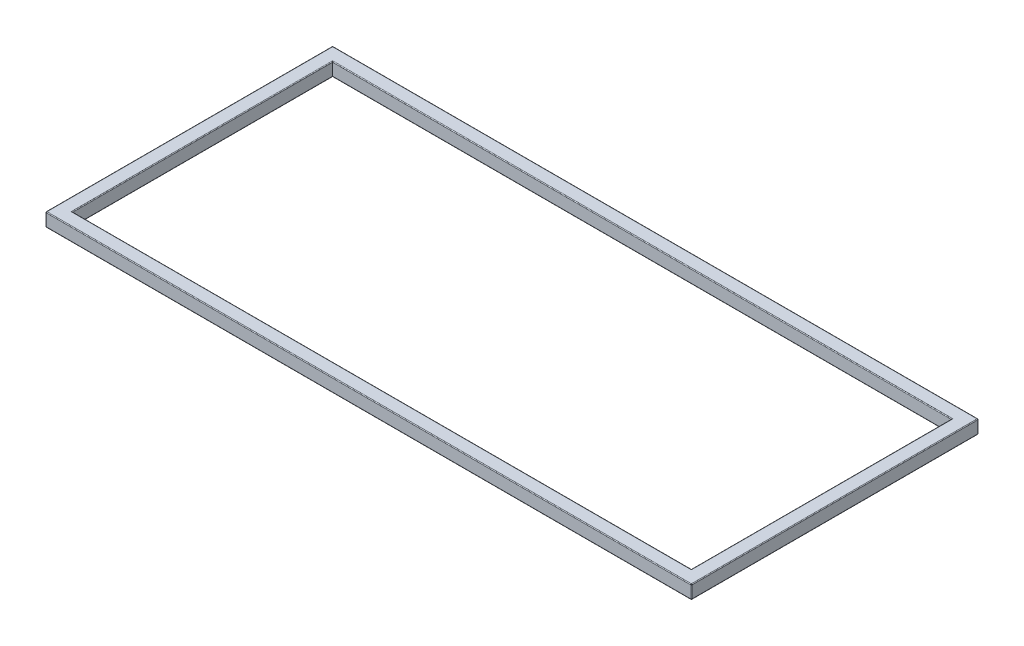
ISO-10303-21;
HEADER;
FILE_DESCRIPTION(('STEP AP214'),'2;1');
FILE_NAME('part.step','',(''),(''),'','','');
FILE_SCHEMA(('AUTOMOTIVE_DESIGN { 1 0 10303 214 1 1 1 1 }'));
ENDSEC;
DATA;
#1=APPLICATION_CONTEXT('core data for automotive mechanical design processes');
#2=APPLICATION_PROTOCOL_DEFINITION('international standard','automotive_design',2000,#1);
#3=PRODUCT_CONTEXT('',#1,'mechanical');
#4=PRODUCT('Part','Part','',(#3));
#5=PRODUCT_RELATED_PRODUCT_CATEGORY('part','',(#4));
#6=PRODUCT_DEFINITION_FORMATION('','',#4);
#7=PRODUCT_DEFINITION_CONTEXT('part definition',#1,'design');
#8=PRODUCT_DEFINITION('design','',#6,#7);
#9=PRODUCT_DEFINITION_SHAPE('','',#8);
#10=(LENGTH_UNIT() NAMED_UNIT(*) SI_UNIT(.MILLI.,.METRE.));
#11=(NAMED_UNIT(*) PLANE_ANGLE_UNIT() SI_UNIT($,.RADIAN.));
#12=(NAMED_UNIT(*) SI_UNIT($,.STERADIAN.) SOLID_ANGLE_UNIT());
#13=UNCERTAINTY_MEASURE_WITH_UNIT(LENGTH_MEASURE(1.E-05),#10,'distance_accuracy_value','');
#14=(GEOMETRIC_REPRESENTATION_CONTEXT(3) GLOBAL_UNCERTAINTY_ASSIGNED_CONTEXT((#13)) GLOBAL_UNIT_ASSIGNED_CONTEXT((#10,
#11,#12)) REPRESENTATION_CONTEXT('',''));
#15=CARTESIAN_POINT('',(0.,0.,0.));
#16=DIRECTION('',(0.,0.,1.));
#17=DIRECTION('',(1.,0.,0.));
#18=AXIS2_PLACEMENT_3D('',#15,#16,#17);
#19=CARTESIAN_POINT('',(0.,19.05,0.));
#20=DIRECTION('',(0.,-1.,0.));
#21=DIRECTION('',(0.,0.,-1.));
#22=AXIS2_PLACEMENT_3D('',#19,#20,#21);
#23=PLANE('',#22);
#24=DIRECTION('',(0.,0.,1.));
#25=VECTOR('',#24,1.);
#26=CARTESIAN_POINT('',(-439.166,19.05,-184.15));
#27=LINE('',#26,#25);
#28=CARTESIAN_POINT('',(-439.166,19.05,185.166));
#29=VERTEX_POINT('',#28);
#30=CARTESIAN_POINT('',(-439.166,19.05,-185.166));
#31=VERTEX_POINT('',#30);
#32=EDGE_CURVE('E347',#29,#31,#27,.F.);
#33=ORIENTED_EDGE('',*,*,#32,.T.);
#34=DIRECTION('',(-1.,0.,0.));
#35=VECTOR('',#34,1.);
#36=CARTESIAN_POINT('',(438.15,19.05,-185.166));
#37=LINE('',#36,#35);
#38=CARTESIAN_POINT('',(439.166,19.05,-185.166));
#39=VERTEX_POINT('',#38);
#40=EDGE_CURVE('E350',#31,#39,#37,.F.);
#41=ORIENTED_EDGE('',*,*,#40,.T.);
#42=DIRECTION('',(0.,0.,-1.));
#43=VECTOR('',#42,1.);
#44=CARTESIAN_POINT('',(439.166,19.05,184.15));
#45=LINE('',#44,#43);
#46=CARTESIAN_POINT('',(439.166,19.05,185.166));
#47=VERTEX_POINT('',#46);
#48=EDGE_CURVE('E341',#39,#47,#45,.F.);
#49=ORIENTED_EDGE('',*,*,#48,.T.);
#50=DIRECTION('',(1.,0.,0.));
#51=VECTOR('',#50,1.);
#52=CARTESIAN_POINT('',(-438.15,19.05,185.166));
#53=LINE('',#52,#51);
#54=EDGE_CURVE('E344',#47,#29,#53,.F.);
#55=ORIENTED_EDGE('',*,*,#54,.T.);
#56=EDGE_LOOP('',(#33,#41,#49,#55));
#57=FACE_BOUND('',#56,.T.);
#58=DIRECTION('',(0.,0.,1.));
#59=VECTOR('',#58,1.);
#60=CARTESIAN_POINT('',(-456.184,19.05,0.));
#61=LINE('',#60,#59);
#62=CARTESIAN_POINT('',(-456.184,19.05,-202.184));
#63=VERTEX_POINT('',#62);
#64=CARTESIAN_POINT('',(-456.184,19.05,202.184));
#65=VERTEX_POINT('',#64);
#66=EDGE_CURVE('E333',#63,#65,#61,.T.);
#67=ORIENTED_EDGE('',*,*,#66,.T.);
#68=DIRECTION('',(1.,0.,0.));
#69=VECTOR('',#68,1.);
#70=CARTESIAN_POINT('',(0.,19.05,202.184));
#71=LINE('',#70,#69);
#72=CARTESIAN_POINT('',(456.184,19.05,202.184));
#73=VERTEX_POINT('',#72);
#74=EDGE_CURVE('E337',#65,#73,#71,.T.);
#75=ORIENTED_EDGE('',*,*,#74,.T.);
#76=DIRECTION('',(0.,0.,-1.));
#77=VECTOR('',#76,1.);
#78=CARTESIAN_POINT('',(456.184,19.05,0.));
#79=LINE('',#78,#77);
#80=CARTESIAN_POINT('',(456.184,19.05,-202.184));
#81=VERTEX_POINT('',#80);
#82=EDGE_CURVE('E320',#73,#81,#79,.T.);
#83=ORIENTED_EDGE('',*,*,#82,.T.);
#84=DIRECTION('',(-1.,0.,0.));
#85=VECTOR('',#84,1.);
#86=CARTESIAN_POINT('',(0.,19.05,-202.184));
#87=LINE('',#86,#85);
#88=EDGE_CURVE('E329',#81,#63,#87,.T.);
#89=ORIENTED_EDGE('',*,*,#88,.T.);
#90=EDGE_LOOP('',(#67,#75,#83,#89));
#91=FACE_BOUND('',#90,.T.);
#92=ADVANCED_FACE('F41',(#57,#91),#23,.F.);
#93=CARTESIAN_POINT('',(0.,0.,0.));
#94=DIRECTION('',(0.,-1.,0.));
#95=DIRECTION('',(0.,0.,-1.));
#96=AXIS2_PLACEMENT_3D('',#93,#94,#95);
#97=PLANE('',#96);
#98=DIRECTION('',(-1.,0.,0.));
#99=VECTOR('',#98,1.);
#100=CARTESIAN_POINT('',(0.,0.,-185.166));
#101=LINE('',#100,#99);
#102=CARTESIAN_POINT('',(439.166,0.,-185.166));
#103=VERTEX_POINT('',#102);
#104=CARTESIAN_POINT('',(-439.166,0.,-185.166));
#105=VERTEX_POINT('',#104);
#106=EDGE_CURVE('E837',#103,#105,#101,.T.);
#107=ORIENTED_EDGE('',*,*,#106,.T.);
#108=DIRECTION('',(0.,0.,1.));
#109=VECTOR('',#108,1.);
#110=CARTESIAN_POINT('',(-439.166,0.,0.));
#111=LINE('',#110,#109);
#112=CARTESIAN_POINT('',(-439.166,0.,185.166));
#113=VERTEX_POINT('',#112);
#114=EDGE_CURVE('E841',#105,#113,#111,.T.);
#115=ORIENTED_EDGE('',*,*,#114,.T.);
#116=DIRECTION('',(1.,0.,0.));
#117=VECTOR('',#116,1.);
#118=CARTESIAN_POINT('',(0.,0.,185.166));
#119=LINE('',#118,#117);
#120=CARTESIAN_POINT('',(439.166,0.,185.166));
#121=VERTEX_POINT('',#120);
#122=EDGE_CURVE('E213',#113,#121,#119,.T.);
#123=ORIENTED_EDGE('',*,*,#122,.T.);
#124=DIRECTION('',(0.,0.,-1.));
#125=VECTOR('',#124,1.);
#126=CARTESIAN_POINT('',(439.166,0.,0.));
#127=LINE('',#126,#125);
#128=EDGE_CURVE('E842',#121,#103,#127,.T.);
#129=ORIENTED_EDGE('',*,*,#128,.T.);
#130=EDGE_LOOP('',(#107,#115,#123,#129));
#131=FACE_BOUND('',#130,.T.);
#132=DIRECTION('',(0.,0.,1.));
#133=VECTOR('',#132,1.);
#134=CARTESIAN_POINT('',(-456.184,0.,-203.2));
#135=LINE('',#134,#133);
#136=CARTESIAN_POINT('',(-456.184,0.,202.184));
#137=VERTEX_POINT('',#136);
#138=CARTESIAN_POINT('',(-456.184,0.,-202.184));
#139=VERTEX_POINT('',#138);
#140=EDGE_CURVE('E211',#137,#139,#135,.F.);
#141=ORIENTED_EDGE('',*,*,#140,.T.);
#142=DIRECTION('',(-1.,0.,0.));
#143=VECTOR('',#142,1.);
#144=CARTESIAN_POINT('',(457.2,0.,-202.184));
#145=LINE('',#144,#143);
#146=CARTESIAN_POINT('',(456.184,0.,-202.184));
#147=VERTEX_POINT('',#146);
#148=EDGE_CURVE('E183',#139,#147,#145,.F.);
#149=ORIENTED_EDGE('',*,*,#148,.T.);
#150=DIRECTION('',(0.,0.,-1.));
#151=VECTOR('',#150,1.);
#152=CARTESIAN_POINT('',(456.184,0.,203.2));
#153=LINE('',#152,#151);
#154=CARTESIAN_POINT('',(456.184,0.,202.184));
#155=VERTEX_POINT('',#154);
#156=EDGE_CURVE('E194',#147,#155,#153,.F.);
#157=ORIENTED_EDGE('',*,*,#156,.T.);
#158=DIRECTION('',(1.,0.,0.));
#159=VECTOR('',#158,1.);
#160=CARTESIAN_POINT('',(-457.2,0.,202.184));
#161=LINE('',#160,#159);
#162=EDGE_CURVE('E205',#155,#137,#161,.F.);
#163=ORIENTED_EDGE('',*,*,#162,.T.);
#164=EDGE_LOOP('',(#141,#149,#157,#163));
#165=FACE_BOUND('',#164,.T.);
#166=ADVANCED_FACE('F209',(#131,#165),#97,.T.);
#167=CARTESIAN_POINT('',(457.2,19.05,203.2));
#168=DIRECTION('',(-1.,0.,0.));
#169=DIRECTION('',(0.,0.,1.));
#170=AXIS2_PLACEMENT_3D('',#167,#168,#169);
#171=PLANE('',#170);
#172=DIRECTION('',(0.,0.,-1.));
#173=VECTOR('',#172,1.);
#174=CARTESIAN_POINT('',(457.2,18.034,203.2));
#175=LINE('',#174,#173);
#176=CARTESIAN_POINT('',(457.2,18.034,-202.184));
#177=VERTEX_POINT('',#176);
#178=CARTESIAN_POINT('',(457.2,18.034,202.184));
#179=VERTEX_POINT('',#178);
#180=EDGE_CURVE('E307',#177,#179,#175,.F.);
#181=ORIENTED_EDGE('',*,*,#180,.T.);
#182=DIRECTION('',(0.,-1.,0.));
#183=VECTOR('',#182,1.);
#184=CARTESIAN_POINT('',(457.2,19.05,202.184));
#185=LINE('',#184,#183);
#186=CARTESIAN_POINT('',(457.2,1.016,202.184));
#187=VERTEX_POINT('',#186);
#188=EDGE_CURVE('E255',#179,#187,#185,.T.);
#189=ORIENTED_EDGE('',*,*,#188,.T.);
#190=DIRECTION('',(0.,0.,-1.));
#191=VECTOR('',#190,1.);
#192=CARTESIAN_POINT('',(457.2,1.016,-203.2));
#193=LINE('',#192,#191);
#194=CARTESIAN_POINT('',(457.2,1.016,-202.184));
#195=VERTEX_POINT('',#194);
#196=EDGE_CURVE('E309',#187,#195,#193,.T.);
#197=ORIENTED_EDGE('',*,*,#196,.T.);
#198=DIRECTION('',(0.,-1.,0.));
#199=VECTOR('',#198,1.);
#200=CARTESIAN_POINT('',(457.2,19.05,-202.184));
#201=LINE('',#200,#199);
#202=EDGE_CURVE('E252',#195,#177,#201,.F.);
#203=ORIENTED_EDGE('',*,*,#202,.T.);
#204=EDGE_LOOP('',(#181,#189,#197,#203));
#205=FACE_BOUND('',#204,.T.);
#206=ADVANCED_FACE('F306',(#205),#171,.F.);
#207=CARTESIAN_POINT('',(-457.2,19.05,-203.2));
#208=DIRECTION('',(0.,0.,1.));
#209=DIRECTION('',(1.,0.,0.));
#210=AXIS2_PLACEMENT_3D('',#207,#208,#209);
#211=PLANE('',#210);
#212=DIRECTION('',(-1.,0.,0.));
#213=VECTOR('',#212,1.);
#214=CARTESIAN_POINT('',(-457.2,1.016,-203.2));
#215=LINE('',#214,#213);
#216=CARTESIAN_POINT('',(456.184,1.016,-203.2));
#217=VERTEX_POINT('',#216);
#218=CARTESIAN_POINT('',(-456.184,1.016,-203.2));
#219=VERTEX_POINT('',#218);
#220=EDGE_CURVE('E184',#217,#219,#215,.T.);
#221=ORIENTED_EDGE('',*,*,#220,.T.);
#222=DIRECTION('',(0.,-1.,0.));
#223=VECTOR('',#222,1.);
#224=CARTESIAN_POINT('',(-456.184,19.05,-203.2));
#225=LINE('',#224,#223);
#226=CARTESIAN_POINT('',(-456.184,18.034,-203.2));
#227=VERTEX_POINT('',#226);
#228=EDGE_CURVE('E11',#219,#227,#225,.F.);
#229=ORIENTED_EDGE('',*,*,#228,.T.);
#230=DIRECTION('',(-1.,0.,0.));
#231=VECTOR('',#230,1.);
#232=CARTESIAN_POINT('',(-457.2,18.034,-203.2));
#233=LINE('',#232,#231);
#234=CARTESIAN_POINT('',(456.184,18.034,-203.2));
#235=VERTEX_POINT('',#234);
#236=EDGE_CURVE('E434',#227,#235,#233,.F.);
#237=ORIENTED_EDGE('',*,*,#236,.T.);
#238=DIRECTION('',(0.,-1.,0.));
#239=VECTOR('',#238,1.);
#240=CARTESIAN_POINT('',(456.184,19.05,-203.2));
#241=LINE('',#240,#239);
#242=EDGE_CURVE('E51',#235,#217,#241,.T.);
#243=ORIENTED_EDGE('',*,*,#242,.T.);
#244=EDGE_LOOP('',(#221,#229,#237,#243));
#245=FACE_BOUND('',#244,.T.);
#246=ADVANCED_FACE('F433',(#245),#211,.F.);
#247=CARTESIAN_POINT('',(-457.2,19.05,203.2));
#248=DIRECTION('',(1.,0.,0.));
#249=DIRECTION('',(0.,0.,-1.));
#250=AXIS2_PLACEMENT_3D('',#247,#248,#249);
#251=PLANE('',#250);
#252=DIRECTION('',(0.,0.,1.));
#253=VECTOR('',#252,1.);
#254=CARTESIAN_POINT('',(-457.2,1.016,203.2));
#255=LINE('',#254,#253);
#256=CARTESIAN_POINT('',(-457.2,1.016,-202.184));
#257=VERTEX_POINT('',#256);
#258=CARTESIAN_POINT('',(-457.2,1.016,202.184));
#259=VERTEX_POINT('',#258);
#260=EDGE_CURVE('E421',#257,#259,#255,.T.);
#261=ORIENTED_EDGE('',*,*,#260,.T.);
#262=DIRECTION('',(0.,-1.,0.));
#263=VECTOR('',#262,1.);
#264=CARTESIAN_POINT('',(-457.2,19.05,202.184));
#265=LINE('',#264,#263);
#266=CARTESIAN_POINT('',(-457.2,18.034,202.184));
#267=VERTEX_POINT('',#266);
#268=EDGE_CURVE('E267',#259,#267,#265,.F.);
#269=ORIENTED_EDGE('',*,*,#268,.T.);
#270=DIRECTION('',(0.,0.,1.));
#271=VECTOR('',#270,1.);
#272=CARTESIAN_POINT('',(-457.2,18.034,203.2));
#273=LINE('',#272,#271);
#274=CARTESIAN_POINT('',(-457.2,18.034,-202.184));
#275=VERTEX_POINT('',#274);
#276=EDGE_CURVE('E423',#267,#275,#273,.F.);
#277=ORIENTED_EDGE('',*,*,#276,.T.);
#278=DIRECTION('',(0.,-1.,0.));
#279=VECTOR('',#278,1.);
#280=CARTESIAN_POINT('',(-457.2,19.05,-202.184));
#281=LINE('',#280,#279);
#282=EDGE_CURVE('E264',#275,#257,#281,.T.);
#283=ORIENTED_EDGE('',*,*,#282,.T.);
#284=EDGE_LOOP('',(#261,#269,#277,#283));
#285=FACE_BOUND('',#284,.T.);
#286=ADVANCED_FACE('F420',(#285),#251,.F.);
#287=CARTESIAN_POINT('',(-457.2,19.05,203.2));
#288=DIRECTION('',(0.,0.,-1.));
#289=DIRECTION('',(-1.,0.,0.));
#290=AXIS2_PLACEMENT_3D('',#287,#288,#289);
#291=PLANE('',#290);
#292=DIRECTION('',(1.,0.,0.));
#293=VECTOR('',#292,1.);
#294=CARTESIAN_POINT('',(457.2,1.016,203.2));
#295=LINE('',#294,#293);
#296=CARTESIAN_POINT('',(-456.184,1.016,203.2));
#297=VERTEX_POINT('',#296);
#298=CARTESIAN_POINT('',(456.184,1.016,203.2));
#299=VERTEX_POINT('',#298);
#300=EDGE_CURVE('E316',#297,#299,#295,.T.);
#301=ORIENTED_EDGE('',*,*,#300,.T.);
#302=DIRECTION('',(0.,-1.,0.));
#303=VECTOR('',#302,1.);
#304=CARTESIAN_POINT('',(456.184,19.05,203.2));
#305=LINE('',#304,#303);
#306=CARTESIAN_POINT('',(456.184,18.034,203.2));
#307=VERTEX_POINT('',#306);
#308=EDGE_CURVE('E261',#299,#307,#305,.F.);
#309=ORIENTED_EDGE('',*,*,#308,.T.);
#310=DIRECTION('',(1.,0.,0.));
#311=VECTOR('',#310,1.);
#312=CARTESIAN_POINT('',(-457.2,18.034,203.2));
#313=LINE('',#312,#311);
#314=CARTESIAN_POINT('',(-456.184,18.034,203.2));
#315=VERTEX_POINT('',#314);
#316=EDGE_CURVE('E323',#307,#315,#313,.F.);
#317=ORIENTED_EDGE('',*,*,#316,.T.);
#318=DIRECTION('',(0.,-1.,0.));
#319=VECTOR('',#318,1.);
#320=CARTESIAN_POINT('',(-456.184,19.05,203.2));
#321=LINE('',#320,#319);
#322=EDGE_CURVE('E258',#315,#297,#321,.T.);
#323=ORIENTED_EDGE('',*,*,#322,.T.);
#324=EDGE_LOOP('',(#301,#309,#317,#323));
#325=FACE_BOUND('',#324,.T.);
#326=ADVANCED_FACE('F450',(#325),#291,.F.);
#327=CARTESIAN_POINT('',(438.15,19.05,184.15));
#328=DIRECTION('',(-1.,0.,0.));
#329=DIRECTION('',(0.,0.,1.));
#330=AXIS2_PLACEMENT_3D('',#327,#328,#329);
#331=PLANE('',#330);
#332=DIRECTION('',(0.,-1.,0.));
#333=VECTOR('',#332,1.);
#334=CARTESIAN_POINT('',(438.15,19.05,-184.15));
#335=LINE('',#334,#333);
#336=CARTESIAN_POINT('',(438.15,18.034,-184.15));
#337=VERTEX_POINT('',#336);
#338=CARTESIAN_POINT('',(438.15,1.01600000000001,-184.15));
#339=VERTEX_POINT('',#338);
#340=EDGE_CURVE('E206',#337,#339,#335,.T.);
#341=ORIENTED_EDGE('',*,*,#340,.T.);
#342=DIRECTION('',(0.,0.,-1.));
#343=VECTOR('',#342,1.);
#344=CARTESIAN_POINT('',(438.15,1.016,184.15));
#345=LINE('',#344,#343);
#346=CARTESIAN_POINT('',(438.15,1.01600000000001,184.15));
#347=VERTEX_POINT('',#346);
#348=EDGE_CURVE('E817',#339,#347,#345,.F.);
#349=ORIENTED_EDGE('',*,*,#348,.T.);
#350=DIRECTION('',(0.,-1.,0.));
#351=VECTOR('',#350,1.);
#352=CARTESIAN_POINT('',(438.15,19.05,184.15));
#353=LINE('',#352,#351);
#354=CARTESIAN_POINT('',(438.15,18.034,184.15));
#355=VERTEX_POINT('',#354);
#356=EDGE_CURVE('E370',#355,#347,#353,.T.);
#357=ORIENTED_EDGE('',*,*,#356,.F.);
#358=DIRECTION('',(0.,0.,-1.));
#359=VECTOR('',#358,1.);
#360=CARTESIAN_POINT('',(438.15,18.034,-184.15));
#361=LINE('',#360,#359);
#362=EDGE_CURVE('E820',#355,#337,#361,.T.);
#363=ORIENTED_EDGE('',*,*,#362,.T.);
#364=EDGE_LOOP('',(#341,#349,#357,#363));
#365=FACE_BOUND('',#364,.T.);
#366=ADVANCED_FACE('F480',(#365),#331,.T.);
#367=CARTESIAN_POINT('',(-438.15,19.05,-184.15));
#368=DIRECTION('',(0.,0.,1.));
#369=DIRECTION('',(1.,0.,0.));
#370=AXIS2_PLACEMENT_3D('',#367,#368,#369);
#371=PLANE('',#370);
#372=DIRECTION('',(0.,-1.,0.));
#373=VECTOR('',#372,1.);
#374=CARTESIAN_POINT('',(-438.15,19.05,-184.15));
#375=LINE('',#374,#373);
#376=CARTESIAN_POINT('',(-438.15,18.034,-184.15));
#377=VERTEX_POINT('',#376);
#378=CARTESIAN_POINT('',(-438.15,1.01600000000001,-184.15));
#379=VERTEX_POINT('',#378);
#380=EDGE_CURVE('E824',#377,#379,#375,.T.);
#381=ORIENTED_EDGE('',*,*,#380,.T.);
#382=DIRECTION('',(-1.,0.,0.));
#383=VECTOR('',#382,1.);
#384=CARTESIAN_POINT('',(-438.15,1.016,-184.15));
#385=LINE('',#384,#383);
#386=EDGE_CURVE('E835',#379,#339,#385,.F.);
#387=ORIENTED_EDGE('',*,*,#386,.T.);
#388=ORIENTED_EDGE('',*,*,#340,.F.);
#389=DIRECTION('',(-1.,0.,0.));
#390=VECTOR('',#389,1.);
#391=CARTESIAN_POINT('',(-438.15,18.034,-184.15));
#392=LINE('',#391,#390);
#393=EDGE_CURVE('E856',#337,#377,#392,.T.);
#394=ORIENTED_EDGE('',*,*,#393,.T.);
#395=EDGE_LOOP('',(#381,#387,#388,#394));
#396=FACE_BOUND('',#395,.T.);
#397=ADVANCED_FACE('F748',(#396),#371,.T.);
#398=CARTESIAN_POINT('',(-438.15,19.05,184.15));
#399=DIRECTION('',(1.,0.,0.));
#400=DIRECTION('',(0.,0.,-1.));
#401=AXIS2_PLACEMENT_3D('',#398,#399,#400);
#402=PLANE('',#401);
#403=DIRECTION('',(0.,-1.,0.));
#404=VECTOR('',#403,1.);
#405=CARTESIAN_POINT('',(-438.15,19.05,184.15));
#406=LINE('',#405,#404);
#407=CARTESIAN_POINT('',(-438.15,18.034,184.15));
#408=VERTEX_POINT('',#407);
#409=CARTESIAN_POINT('',(-438.15,1.01600000000001,184.15));
#410=VERTEX_POINT('',#409);
#411=EDGE_CURVE('E866',#408,#410,#406,.T.);
#412=ORIENTED_EDGE('',*,*,#411,.T.);
#413=DIRECTION('',(0.,0.,1.));
#414=VECTOR('',#413,1.);
#415=CARTESIAN_POINT('',(-438.15,1.016,184.15));
#416=LINE('',#415,#414);
#417=EDGE_CURVE('E853',#410,#379,#416,.F.);
#418=ORIENTED_EDGE('',*,*,#417,.T.);
#419=ORIENTED_EDGE('',*,*,#380,.F.);
#420=DIRECTION('',(0.,0.,1.));
#421=VECTOR('',#420,1.);
#422=CARTESIAN_POINT('',(-438.15,18.034,184.15));
#423=LINE('',#422,#421);
#424=EDGE_CURVE('E846',#377,#408,#423,.T.);
#425=ORIENTED_EDGE('',*,*,#424,.T.);
#426=EDGE_LOOP('',(#412,#418,#419,#425));
#427=FACE_BOUND('',#426,.T.);
#428=ADVANCED_FACE('F739',(#427),#402,.T.);
#429=CARTESIAN_POINT('',(-438.15,19.05,184.15));
#430=DIRECTION('',(0.,0.,-1.));
#431=DIRECTION('',(-1.,0.,0.));
#432=AXIS2_PLACEMENT_3D('',#429,#430,#431);
#433=PLANE('',#432);
#434=ORIENTED_EDGE('',*,*,#356,.T.);
#435=DIRECTION('',(1.,0.,0.));
#436=VECTOR('',#435,1.);
#437=CARTESIAN_POINT('',(-438.15,1.016,184.15));
#438=LINE('',#437,#436);
#439=EDGE_CURVE('E438',#347,#410,#438,.F.);
#440=ORIENTED_EDGE('',*,*,#439,.T.);
#441=ORIENTED_EDGE('',*,*,#411,.F.);
#442=DIRECTION('',(1.,0.,0.));
#443=VECTOR('',#442,1.);
#444=CARTESIAN_POINT('',(438.15,18.034,184.15));
#445=LINE('',#444,#443);
#446=EDGE_CURVE('E443',#408,#355,#445,.T.);
#447=ORIENTED_EDGE('',*,*,#446,.T.);
#448=EDGE_LOOP('',(#434,#440,#441,#447));
#449=FACE_BOUND('',#448,.T.);
#450=ADVANCED_FACE('F507',(#449),#433,.T.);
#451=CARTESIAN_POINT('',(439.166,1.016,0.));
#452=DIRECTION('',(0.,0.,-1.));
#453=DIRECTION('',(-1.,0.,0.));
#454=AXIS2_PLACEMENT_3D('',#451,#452,#453);
#455=CYLINDRICAL_SURFACE('',#454,1.016);
#456=CARTESIAN_POINT('',(439.166,1.016,185.166));
#457=DIRECTION('',(0.707106781186547,0.,-0.707106781186547));
#458=DIRECTION('',(-0.707106781186547,0.,-0.707106781186547));
#459=AXIS2_PLACEMENT_3D('',#456,#457,#458);
#460=ELLIPSE('',#459,1.43684097937106,1.016);
#461=EDGE_CURVE('E362',#347,#121,#460,.F.);
#462=ORIENTED_EDGE('',*,*,#461,.F.);
#463=ORIENTED_EDGE('',*,*,#348,.F.);
#464=CARTESIAN_POINT('',(439.166,1.016,-185.166));
#465=DIRECTION('',(-0.707106781186547,0.,-0.707106781186547));
#466=DIRECTION('',(-0.707106781186547,0.,0.707106781186547));
#467=AXIS2_PLACEMENT_3D('',#464,#465,#466);
#468=ELLIPSE('',#467,1.43684097937106,1.016);
#469=EDGE_CURVE('E366',#103,#339,#468,.T.);
#470=ORIENTED_EDGE('',*,*,#469,.F.);
#471=ORIENTED_EDGE('',*,*,#128,.F.);
#472=EDGE_LOOP('',(#462,#463,#470,#471));
#473=FACE_BOUND('',#472,.T.);
#474=ADVANCED_FACE('F503',(#473),#455,.T.);
#475=CARTESIAN_POINT('',(0.,1.016,-185.166));
#476=DIRECTION('',(-1.,0.,0.));
#477=DIRECTION('',(0.,0.,1.));
#478=AXIS2_PLACEMENT_3D('',#475,#476,#477);
#479=CYLINDRICAL_SURFACE('',#478,1.016);
#480=ORIENTED_EDGE('',*,*,#469,.T.);
#481=ORIENTED_EDGE('',*,*,#386,.F.);
#482=CARTESIAN_POINT('',(-439.166,1.016,-185.166));
#483=DIRECTION('',(-0.707106781186547,0.,0.707106781186547));
#484=DIRECTION('',(0.707106781186547,0.,0.707106781186547));
#485=AXIS2_PLACEMENT_3D('',#482,#483,#484);
#486=ELLIPSE('',#485,1.43684097937106,1.016);
#487=EDGE_CURVE('E358',#105,#379,#486,.T.);
#488=ORIENTED_EDGE('',*,*,#487,.F.);
#489=ORIENTED_EDGE('',*,*,#106,.F.);
#490=EDGE_LOOP('',(#480,#481,#488,#489));
#491=FACE_BOUND('',#490,.T.);
#492=ADVANCED_FACE('F499',(#491),#479,.T.);
#493=CARTESIAN_POINT('',(0.,1.016,185.166));
#494=DIRECTION('',(1.,0.,0.));
#495=DIRECTION('',(0.,0.,-1.));
#496=AXIS2_PLACEMENT_3D('',#493,#494,#495);
#497=CYLINDRICAL_SURFACE('',#496,1.016);
#498=ORIENTED_EDGE('',*,*,#461,.T.);
#499=ORIENTED_EDGE('',*,*,#122,.F.);
#500=CARTESIAN_POINT('',(-439.166,1.016,185.166));
#501=DIRECTION('',(0.707106781186547,0.,0.707106781186547));
#502=DIRECTION('',(-0.707106781186547,0.,0.707106781186547));
#503=AXIS2_PLACEMENT_3D('',#500,#501,#502);
#504=ELLIPSE('',#503,1.43684097937106,1.016);
#505=EDGE_CURVE('E355',#410,#113,#504,.F.);
#506=ORIENTED_EDGE('',*,*,#505,.F.);
#507=ORIENTED_EDGE('',*,*,#439,.F.);
#508=EDGE_LOOP('',(#498,#499,#506,#507));
#509=FACE_BOUND('',#508,.T.);
#510=ADVANCED_FACE('F495',(#509),#497,.T.);
#511=CARTESIAN_POINT('',(-439.166,1.016,0.));
#512=DIRECTION('',(0.,0.,1.));
#513=DIRECTION('',(1.,0.,0.));
#514=AXIS2_PLACEMENT_3D('',#511,#512,#513);
#515=CYLINDRICAL_SURFACE('',#514,1.016);
#516=ORIENTED_EDGE('',*,*,#487,.T.);
#517=ORIENTED_EDGE('',*,*,#417,.F.);
#518=ORIENTED_EDGE('',*,*,#505,.T.);
#519=ORIENTED_EDGE('',*,*,#114,.F.);
#520=EDGE_LOOP('',(#516,#517,#518,#519));
#521=FACE_BOUND('',#520,.T.);
#522=ADVANCED_FACE('F491',(#521),#515,.T.);
#523=CARTESIAN_POINT('',(-457.2,1.016,202.184));
#524=DIRECTION('',(-1.,0.,0.));
#525=DIRECTION('',(0.,0.,1.));
#526=AXIS2_PLACEMENT_3D('',#523,#524,#525);
#527=CYLINDRICAL_SURFACE('',#526,1.016);
#528=ORIENTED_EDGE('',*,*,#162,.F.);
#529=CARTESIAN_POINT('',(456.184,1.016,202.184));
#530=DIRECTION('',(-1.,0.,0.));
#531=DIRECTION('',(0.,0.,1.));
#532=AXIS2_PLACEMENT_3D('',#529,#530,#531);
#533=CIRCLE('',#532,1.016);
#534=EDGE_CURVE('E229',#155,#299,#533,.T.);
#535=ORIENTED_EDGE('',*,*,#534,.T.);
#536=ORIENTED_EDGE('',*,*,#300,.F.);
#537=CARTESIAN_POINT('',(-456.184,1.016,202.184));
#538=DIRECTION('',(-1.,0.,0.));
#539=DIRECTION('',(0.,0.,1.));
#540=AXIS2_PLACEMENT_3D('',#537,#538,#539);
#541=CIRCLE('',#540,1.016);
#542=EDGE_CURVE('E221',#297,#137,#541,.F.);
#543=ORIENTED_EDGE('',*,*,#542,.T.);
#544=EDGE_LOOP('',(#528,#535,#536,#543));
#545=FACE_BOUND('',#544,.T.);
#546=ADVANCED_FACE('F494',(#545),#527,.T.);
#547=CARTESIAN_POINT('',(456.184,1.016,203.2));
#548=DIRECTION('',(0.,0.,1.));
#549=DIRECTION('',(1.,0.,0.));
#550=AXIS2_PLACEMENT_3D('',#547,#548,#549);
#551=CYLINDRICAL_SURFACE('',#550,1.016);
#552=ORIENTED_EDGE('',*,*,#196,.F.);
#553=CARTESIAN_POINT('',(456.184,1.016,202.184));
#554=DIRECTION('',(0.,0.,1.));
#555=DIRECTION('',(1.,0.,0.));
#556=AXIS2_PLACEMENT_3D('',#553,#554,#555);
#557=CIRCLE('',#556,1.016);
#558=EDGE_CURVE('E200',#187,#155,#557,.F.);
#559=ORIENTED_EDGE('',*,*,#558,.T.);
#560=ORIENTED_EDGE('',*,*,#156,.F.);
#561=CARTESIAN_POINT('',(456.184,1.016,-202.184));
#562=DIRECTION('',(0.,0.,1.));
#563=DIRECTION('',(1.,0.,0.));
#564=AXIS2_PLACEMENT_3D('',#561,#562,#563);
#565=CIRCLE('',#564,1.016);
#566=EDGE_CURVE('E197',#147,#195,#565,.T.);
#567=ORIENTED_EDGE('',*,*,#566,.T.);
#568=EDGE_LOOP('',(#552,#559,#560,#567));
#569=FACE_BOUND('',#568,.T.);
#570=ADVANCED_FACE('F196',(#569),#551,.T.);
#571=CARTESIAN_POINT('',(-456.184,1.016,203.2));
#572=DIRECTION('',(0.,0.,-1.));
#573=DIRECTION('',(-1.,0.,0.));
#574=AXIS2_PLACEMENT_3D('',#571,#572,#573);
#575=CYLINDRICAL_SURFACE('',#574,1.016);
#576=ORIENTED_EDGE('',*,*,#140,.F.);
#577=CARTESIAN_POINT('',(-456.184,1.016,202.184));
#578=DIRECTION('',(0.,0.,-1.));
#579=DIRECTION('',(-1.,0.,0.));
#580=AXIS2_PLACEMENT_3D('',#577,#578,#579);
#581=CIRCLE('',#580,1.016);
#582=EDGE_CURVE('E242',#137,#259,#581,.T.);
#583=ORIENTED_EDGE('',*,*,#582,.T.);
#584=ORIENTED_EDGE('',*,*,#260,.F.);
#585=CARTESIAN_POINT('',(-456.184,1.016,-202.184));
#586=DIRECTION('',(0.,0.,-1.));
#587=DIRECTION('',(-1.,0.,0.));
#588=AXIS2_PLACEMENT_3D('',#585,#586,#587);
#589=CIRCLE('',#588,1.016);
#590=EDGE_CURVE('E239',#257,#139,#589,.F.);
#591=ORIENTED_EDGE('',*,*,#590,.T.);
#592=EDGE_LOOP('',(#576,#583,#584,#591));
#593=FACE_BOUND('',#592,.T.);
#594=ADVANCED_FACE('F426',(#593),#575,.T.);
#595=CARTESIAN_POINT('',(-457.2,1.016,-202.184));
#596=DIRECTION('',(1.,0.,0.));
#597=DIRECTION('',(0.,0.,-1.));
#598=AXIS2_PLACEMENT_3D('',#595,#596,#597);
#599=CYLINDRICAL_SURFACE('',#598,1.016);
#600=ORIENTED_EDGE('',*,*,#148,.F.);
#601=CARTESIAN_POINT('',(-456.184,1.016,-202.184));
#602=DIRECTION('',(1.,0.,0.));
#603=DIRECTION('',(0.,0.,-1.));
#604=AXIS2_PLACEMENT_3D('',#601,#602,#603);
#605=CIRCLE('',#604,1.016);
#606=EDGE_CURVE('E59',#139,#219,#605,.T.);
#607=ORIENTED_EDGE('',*,*,#606,.T.);
#608=ORIENTED_EDGE('',*,*,#220,.F.);
#609=CARTESIAN_POINT('',(456.184,1.016,-202.184));
#610=DIRECTION('',(1.,0.,0.));
#611=DIRECTION('',(0.,0.,-1.));
#612=AXIS2_PLACEMENT_3D('',#609,#610,#611);
#613=CIRCLE('',#612,1.016);
#614=EDGE_CURVE('E179',#217,#147,#613,.F.);
#615=ORIENTED_EDGE('',*,*,#614,.T.);
#616=EDGE_LOOP('',(#600,#607,#608,#615));
#617=FACE_BOUND('',#616,.T.);
#618=ADVANCED_FACE('F181',(#617),#599,.T.);
#619=CARTESIAN_POINT('',(-438.15,18.034,185.166));
#620=DIRECTION('',(-1.,0.,0.));
#621=DIRECTION('',(0.,0.,1.));
#622=AXIS2_PLACEMENT_3D('',#619,#620,#621);
#623=CYLINDRICAL_SURFACE('',#622,1.016);
#624=CARTESIAN_POINT('',(-439.166,18.034,185.166));
#625=DIRECTION('',(-0.707106781186547,0.,-0.707106781186547));
#626=DIRECTION('',(0.707106781186547,0.,-0.707106781186547));
#627=AXIS2_PLACEMENT_3D('',#624,#625,#626);
#628=ELLIPSE('',#627,1.43684097937106,1.016);
#629=EDGE_CURVE('E376',#29,#408,#628,.T.);
#630=ORIENTED_EDGE('',*,*,#629,.F.);
#631=ORIENTED_EDGE('',*,*,#54,.F.);
#632=CARTESIAN_POINT('',(439.166,18.034,185.166));
#633=DIRECTION('',(-0.707106781186547,0.,0.707106781186547));
#634=DIRECTION('',(-0.707106781186547,0.,-0.707106781186547));
#635=AXIS2_PLACEMENT_3D('',#632,#633,#634);
#636=ELLIPSE('',#635,1.43684097937106,1.016);
#637=EDGE_CURVE('E359',#355,#47,#636,.F.);
#638=ORIENTED_EDGE('',*,*,#637,.F.);
#639=ORIENTED_EDGE('',*,*,#446,.F.);
#640=EDGE_LOOP('',(#630,#631,#638,#639));
#641=FACE_BOUND('',#640,.T.);
#642=ADVANCED_FACE('F511',(#641),#623,.T.);
#643=CARTESIAN_POINT('',(439.166,18.034,184.15));
#644=DIRECTION('',(0.,0.,1.));
#645=DIRECTION('',(1.,0.,0.));
#646=AXIS2_PLACEMENT_3D('',#643,#644,#645);
#647=CYLINDRICAL_SURFACE('',#646,1.016);
#648=ORIENTED_EDGE('',*,*,#637,.T.);
#649=ORIENTED_EDGE('',*,*,#48,.F.);
#650=CARTESIAN_POINT('',(439.166,18.034,-185.166));
#651=DIRECTION('',(0.707106781186547,0.,0.707106781186547));
#652=DIRECTION('',(0.707106781186547,0.,-0.707106781186547));
#653=AXIS2_PLACEMENT_3D('',#650,#651,#652);
#654=ELLIPSE('',#653,1.43684097937106,1.016);
#655=EDGE_CURVE('E373',#337,#39,#654,.F.);
#656=ORIENTED_EDGE('',*,*,#655,.F.);
#657=ORIENTED_EDGE('',*,*,#362,.F.);
#658=EDGE_LOOP('',(#648,#649,#656,#657));
#659=FACE_BOUND('',#658,.T.);
#660=ADVANCED_FACE('F526',(#659),#647,.T.);
#661=CARTESIAN_POINT('',(-439.166,18.034,184.15));
#662=DIRECTION('',(0.,0.,-1.));
#663=DIRECTION('',(-1.,0.,0.));
#664=AXIS2_PLACEMENT_3D('',#661,#662,#663);
#665=CYLINDRICAL_SURFACE('',#664,1.016);
#666=ORIENTED_EDGE('',*,*,#629,.T.);
#667=ORIENTED_EDGE('',*,*,#424,.F.);
#668=CARTESIAN_POINT('',(-439.166,18.034,-185.166));
#669=DIRECTION('',(0.707106781186547,0.,-0.707106781186547));
#670=DIRECTION('',(0.707106781186547,0.,0.707106781186547));
#671=AXIS2_PLACEMENT_3D('',#668,#669,#670);
#672=ELLIPSE('',#671,1.43684097937106,1.016);
#673=EDGE_CURVE('E281',#31,#377,#672,.T.);
#674=ORIENTED_EDGE('',*,*,#673,.F.);
#675=ORIENTED_EDGE('',*,*,#32,.F.);
#676=EDGE_LOOP('',(#666,#667,#674,#675));
#677=FACE_BOUND('',#676,.T.);
#678=ADVANCED_FACE('F522',(#677),#665,.T.);
#679=CARTESIAN_POINT('',(-438.15,18.034,-185.166));
#680=DIRECTION('',(1.,0.,0.));
#681=DIRECTION('',(0.,0.,-1.));
#682=AXIS2_PLACEMENT_3D('',#679,#680,#681);
#683=CYLINDRICAL_SURFACE('',#682,1.016);
#684=ORIENTED_EDGE('',*,*,#655,.T.);
#685=ORIENTED_EDGE('',*,*,#40,.F.);
#686=ORIENTED_EDGE('',*,*,#673,.T.);
#687=ORIENTED_EDGE('',*,*,#393,.F.);
#688=EDGE_LOOP('',(#684,#685,#686,#687));
#689=FACE_BOUND('',#688,.T.);
#690=ADVANCED_FACE('F519',(#689),#683,.T.);
#691=CARTESIAN_POINT('',(0.,18.034,-202.184));
#692=DIRECTION('',(-1.,0.,0.));
#693=DIRECTION('',(0.,0.,1.));
#694=AXIS2_PLACEMENT_3D('',#691,#692,#693);
#695=CYLINDRICAL_SURFACE('',#694,1.016);
#696=ORIENTED_EDGE('',*,*,#236,.F.);
#697=CARTESIAN_POINT('',(-456.184,18.034,-202.184));
#698=DIRECTION('',(-1.,0.,0.));
#699=DIRECTION('',(0.,0.,1.));
#700=AXIS2_PLACEMENT_3D('',#697,#698,#699);
#701=CIRCLE('',#700,1.016);
#702=EDGE_CURVE('E190',#227,#63,#701,.F.);
#703=ORIENTED_EDGE('',*,*,#702,.T.);
#704=ORIENTED_EDGE('',*,*,#88,.F.);
#705=CARTESIAN_POINT('',(456.184,18.034,-202.184));
#706=DIRECTION('',(-1.,0.,0.));
#707=DIRECTION('',(0.,0.,1.));
#708=AXIS2_PLACEMENT_3D('',#705,#706,#707);
#709=CIRCLE('',#708,1.016);
#710=EDGE_CURVE('E245',#81,#235,#709,.T.);
#711=ORIENTED_EDGE('',*,*,#710,.T.);
#712=EDGE_LOOP('',(#696,#703,#704,#711));
#713=FACE_BOUND('',#712,.T.);
#714=ADVANCED_FACE('F436',(#713),#695,.T.);
#715=CARTESIAN_POINT('',(-456.184,18.034,0.));
#716=DIRECTION('',(0.,0.,1.));
#717=DIRECTION('',(1.,0.,0.));
#718=AXIS2_PLACEMENT_3D('',#715,#716,#717);
#719=CYLINDRICAL_SURFACE('',#718,1.016);
#720=ORIENTED_EDGE('',*,*,#276,.F.);
#721=CARTESIAN_POINT('',(-456.184,18.034,202.184));
#722=DIRECTION('',(0.,0.,1.));
#723=DIRECTION('',(1.,0.,0.));
#724=AXIS2_PLACEMENT_3D('',#721,#722,#723);
#725=CIRCLE('',#724,1.016);
#726=EDGE_CURVE('E236',#267,#65,#725,.F.);
#727=ORIENTED_EDGE('',*,*,#726,.T.);
#728=ORIENTED_EDGE('',*,*,#66,.F.);
#729=CARTESIAN_POINT('',(-456.184,18.034,-202.184));
#730=DIRECTION('',(0.,0.,1.));
#731=DIRECTION('',(1.,0.,0.));
#732=AXIS2_PLACEMENT_3D('',#729,#730,#731);
#733=CIRCLE('',#732,1.016);
#734=EDGE_CURVE('E232',#63,#275,#733,.T.);
#735=ORIENTED_EDGE('',*,*,#734,.T.);
#736=EDGE_LOOP('',(#720,#727,#728,#735));
#737=FACE_BOUND('',#736,.T.);
#738=ADVANCED_FACE('F405',(#737),#719,.T.);
#739=CARTESIAN_POINT('',(456.184,18.034,0.));
#740=DIRECTION('',(0.,0.,-1.));
#741=DIRECTION('',(-1.,0.,0.));
#742=AXIS2_PLACEMENT_3D('',#739,#740,#741);
#743=CYLINDRICAL_SURFACE('',#742,1.016);
#744=ORIENTED_EDGE('',*,*,#82,.F.);
#745=CARTESIAN_POINT('',(456.184,18.034,202.184));
#746=DIRECTION('',(0.,0.,-1.));
#747=DIRECTION('',(-1.,0.,0.));
#748=AXIS2_PLACEMENT_3D('',#745,#746,#747);
#749=CIRCLE('',#748,1.016);
#750=EDGE_CURVE('E217',#73,#179,#749,.T.);
#751=ORIENTED_EDGE('',*,*,#750,.T.);
#752=ORIENTED_EDGE('',*,*,#180,.F.);
#753=CARTESIAN_POINT('',(456.184,18.034,-202.184));
#754=DIRECTION('',(0.,0.,-1.));
#755=DIRECTION('',(-1.,0.,0.));
#756=AXIS2_PLACEMENT_3D('',#753,#754,#755);
#757=CIRCLE('',#756,1.016);
#758=EDGE_CURVE('E223',#177,#81,#757,.F.);
#759=ORIENTED_EDGE('',*,*,#758,.T.);
#760=EDGE_LOOP('',(#744,#751,#752,#759));
#761=FACE_BOUND('',#760,.T.);
#762=ADVANCED_FACE('F313',(#761),#743,.T.);
#763=CARTESIAN_POINT('',(0.,18.034,202.184));
#764=DIRECTION('',(1.,0.,0.));
#765=DIRECTION('',(0.,0.,-1.));
#766=AXIS2_PLACEMENT_3D('',#763,#764,#765);
#767=CYLINDRICAL_SURFACE('',#766,1.016);
#768=ORIENTED_EDGE('',*,*,#316,.F.);
#769=CARTESIAN_POINT('',(456.184,18.034,202.184));
#770=DIRECTION('',(1.,0.,0.));
#771=DIRECTION('',(0.,0.,-1.));
#772=AXIS2_PLACEMENT_3D('',#769,#770,#771);
#773=CIRCLE('',#772,1.016);
#774=EDGE_CURVE('E386',#307,#73,#773,.F.);
#775=ORIENTED_EDGE('',*,*,#774,.T.);
#776=ORIENTED_EDGE('',*,*,#74,.F.);
#777=CARTESIAN_POINT('',(-456.184,18.034,202.184));
#778=DIRECTION('',(1.,0.,0.));
#779=DIRECTION('',(0.,0.,-1.));
#780=AXIS2_PLACEMENT_3D('',#777,#778,#779);
#781=CIRCLE('',#780,1.016);
#782=EDGE_CURVE('E354',#65,#315,#781,.T.);
#783=ORIENTED_EDGE('',*,*,#782,.T.);
#784=EDGE_LOOP('',(#768,#775,#776,#783));
#785=FACE_BOUND('',#784,.T.);
#786=ADVANCED_FACE('F394',(#785),#767,.T.);
#787=CARTESIAN_POINT('',(456.184,1.016,202.184));
#788=DIRECTION('',(0.,0.,1.));
#789=DIRECTION('',(1.,0.,0.));
#790=AXIS2_PLACEMENT_3D('',#787,#788,#789);
#791=SPHERICAL_SURFACE('',#790,1.016);
#792=ORIENTED_EDGE('',*,*,#534,.F.);
#793=ORIENTED_EDGE('',*,*,#558,.F.);
#794=CARTESIAN_POINT('',(456.184,1.016,202.184));
#795=DIRECTION('',(0.,1.,0.));
#796=DIRECTION('',(0.,0.,1.));
#797=AXIS2_PLACEMENT_3D('',#794,#795,#796);
#798=CIRCLE('',#797,1.016);
#799=EDGE_CURVE('E276',#299,#187,#798,.T.);
#800=ORIENTED_EDGE('',*,*,#799,.F.);
#801=EDGE_LOOP('',(#792,#793,#800));
#802=FACE_BOUND('',#801,.T.);
#803=ADVANCED_FACE('F468',(#802),#791,.T.);
#804=CARTESIAN_POINT('',(456.184,19.05,202.184));
#805=DIRECTION('',(0.,-1.,0.));
#806=DIRECTION('',(0.,0.,-1.));
#807=AXIS2_PLACEMENT_3D('',#804,#805,#806);
#808=CYLINDRICAL_SURFACE('',#807,1.016);
#809=ORIENTED_EDGE('',*,*,#799,.T.);
#810=ORIENTED_EDGE('',*,*,#188,.F.);
#811=CARTESIAN_POINT('',(456.184,18.034,202.184));
#812=DIRECTION('',(0.,1.,0.));
#813=DIRECTION('',(0.,0.,1.));
#814=AXIS2_PLACEMENT_3D('',#811,#812,#813);
#815=CIRCLE('',#814,1.016);
#816=EDGE_CURVE('E272',#307,#179,#815,.T.);
#817=ORIENTED_EDGE('',*,*,#816,.F.);
#818=ORIENTED_EDGE('',*,*,#308,.F.);
#819=EDGE_LOOP('',(#809,#810,#817,#818));
#820=FACE_BOUND('',#819,.T.);
#821=ADVANCED_FACE('F456',(#820),#808,.T.);
#822=CARTESIAN_POINT('',(456.184,18.034,202.184));
#823=DIRECTION('',(0.,0.,1.));
#824=DIRECTION('',(1.,0.,0.));
#825=AXIS2_PLACEMENT_3D('',#822,#823,#824);
#826=SPHERICAL_SURFACE('',#825,1.016);
#827=ORIENTED_EDGE('',*,*,#816,.T.);
#828=ORIENTED_EDGE('',*,*,#750,.F.);
#829=ORIENTED_EDGE('',*,*,#774,.F.);
#830=EDGE_LOOP('',(#827,#828,#829));
#831=FACE_BOUND('',#830,.T.);
#832=ADVANCED_FACE('F457',(#831),#826,.T.);
#833=CARTESIAN_POINT('',(-456.184,1.016,202.184));
#834=DIRECTION('',(0.,0.,1.));
#835=DIRECTION('',(1.,0.,0.));
#836=AXIS2_PLACEMENT_3D('',#833,#834,#835);
#837=SPHERICAL_SURFACE('',#836,1.016);
#838=ORIENTED_EDGE('',*,*,#582,.F.);
#839=ORIENTED_EDGE('',*,*,#542,.F.);
#840=CARTESIAN_POINT('',(-456.184,1.016,202.184));
#841=DIRECTION('',(0.,1.,0.));
#842=DIRECTION('',(0.,0.,1.));
#843=AXIS2_PLACEMENT_3D('',#840,#841,#842);
#844=CIRCLE('',#843,1.016);
#845=EDGE_CURVE('E277',#259,#297,#844,.T.);
#846=ORIENTED_EDGE('',*,*,#845,.F.);
#847=EDGE_LOOP('',(#838,#839,#846));
#848=FACE_BOUND('',#847,.T.);
#849=ADVANCED_FACE('F459',(#848),#837,.T.);
#850=CARTESIAN_POINT('',(-456.184,19.05,202.184));
#851=DIRECTION('',(0.,-1.,0.));
#852=DIRECTION('',(0.,0.,-1.));
#853=AXIS2_PLACEMENT_3D('',#850,#851,#852);
#854=CYLINDRICAL_SURFACE('',#853,1.016);
#855=ORIENTED_EDGE('',*,*,#845,.T.);
#856=ORIENTED_EDGE('',*,*,#322,.F.);
#857=CARTESIAN_POINT('',(-456.184,18.034,202.184));
#858=DIRECTION('',(0.,1.,0.));
#859=DIRECTION('',(0.,0.,1.));
#860=AXIS2_PLACEMENT_3D('',#857,#858,#859);
#861=CIRCLE('',#860,1.016);
#862=EDGE_CURVE('E282',#267,#315,#861,.T.);
#863=ORIENTED_EDGE('',*,*,#862,.F.);
#864=ORIENTED_EDGE('',*,*,#268,.F.);
#865=EDGE_LOOP('',(#855,#856,#863,#864));
#866=FACE_BOUND('',#865,.T.);
#867=ADVANCED_FACE('F465',(#866),#854,.T.);
#868=CARTESIAN_POINT('',(-456.184,18.034,202.184));
#869=DIRECTION('',(0.,0.,1.));
#870=DIRECTION('',(1.,0.,0.));
#871=AXIS2_PLACEMENT_3D('',#868,#869,#870);
#872=SPHERICAL_SURFACE('',#871,1.016);
#873=ORIENTED_EDGE('',*,*,#782,.F.);
#874=ORIENTED_EDGE('',*,*,#726,.F.);
#875=ORIENTED_EDGE('',*,*,#862,.T.);
#876=EDGE_LOOP('',(#873,#874,#875));
#877=FACE_BOUND('',#876,.T.);
#878=ADVANCED_FACE('F589',(#877),#872,.T.);
#879=CARTESIAN_POINT('',(-456.184,1.016,-202.184));
#880=DIRECTION('',(0.,0.,1.));
#881=DIRECTION('',(1.,0.,0.));
#882=AXIS2_PLACEMENT_3D('',#879,#880,#881);
#883=SPHERICAL_SURFACE('',#882,1.016);
#884=ORIENTED_EDGE('',*,*,#606,.F.);
#885=ORIENTED_EDGE('',*,*,#590,.F.);
#886=CARTESIAN_POINT('',(-456.184,1.016,-202.184));
#887=DIRECTION('',(0.,1.,0.));
#888=DIRECTION('',(0.,0.,1.));
#889=AXIS2_PLACEMENT_3D('',#886,#887,#888);
#890=CIRCLE('',#889,1.016);
#891=EDGE_CURVE('E285',#219,#257,#890,.T.);
#892=ORIENTED_EDGE('',*,*,#891,.F.);
#893=EDGE_LOOP('',(#884,#885,#892));
#894=FACE_BOUND('',#893,.T.);
#895=ADVANCED_FACE('F431',(#894),#883,.T.);
#896=CARTESIAN_POINT('',(-456.184,19.05,-202.184));
#897=DIRECTION('',(0.,-1.,0.));
#898=DIRECTION('',(0.,0.,-1.));
#899=AXIS2_PLACEMENT_3D('',#896,#897,#898);
#900=CYLINDRICAL_SURFACE('',#899,1.016);
#901=ORIENTED_EDGE('',*,*,#891,.T.);
#902=ORIENTED_EDGE('',*,*,#282,.F.);
#903=CARTESIAN_POINT('',(-456.184,18.034,-202.184));
#904=DIRECTION('',(0.,1.,0.));
#905=DIRECTION('',(0.,0.,1.));
#906=AXIS2_PLACEMENT_3D('',#903,#904,#905);
#907=CIRCLE('',#906,1.016);
#908=EDGE_CURVE('E289',#227,#275,#907,.T.);
#909=ORIENTED_EDGE('',*,*,#908,.F.);
#910=ORIENTED_EDGE('',*,*,#228,.F.);
#911=EDGE_LOOP('',(#901,#902,#909,#910));
#912=FACE_BOUND('',#911,.T.);
#913=ADVANCED_FACE('F415',(#912),#900,.T.);
#914=CARTESIAN_POINT('',(-456.184,18.034,-202.184));
#915=DIRECTION('',(0.,0.,1.));
#916=DIRECTION('',(1.,0.,0.));
#917=AXIS2_PLACEMENT_3D('',#914,#915,#916);
#918=SPHERICAL_SURFACE('',#917,1.016);
#919=ORIENTED_EDGE('',*,*,#734,.F.);
#920=ORIENTED_EDGE('',*,*,#702,.F.);
#921=ORIENTED_EDGE('',*,*,#908,.T.);
#922=EDGE_LOOP('',(#919,#920,#921));
#923=FACE_BOUND('',#922,.T.);
#924=ADVANCED_FACE('F410',(#923),#918,.T.);
#925=CARTESIAN_POINT('',(456.184,1.016,-202.184));
#926=DIRECTION('',(0.,0.,1.));
#927=DIRECTION('',(1.,0.,0.));
#928=AXIS2_PLACEMENT_3D('',#925,#926,#927);
#929=SPHERICAL_SURFACE('',#928,1.016);
#930=ORIENTED_EDGE('',*,*,#566,.F.);
#931=ORIENTED_EDGE('',*,*,#614,.F.);
#932=CARTESIAN_POINT('',(456.184,1.016,-202.184));
#933=DIRECTION('',(0.,1.,0.));
#934=DIRECTION('',(0.,0.,1.));
#935=AXIS2_PLACEMENT_3D('',#932,#933,#934);
#936=CIRCLE('',#935,1.016);
#937=EDGE_CURVE('E45',#195,#217,#936,.T.);
#938=ORIENTED_EDGE('',*,*,#937,.F.);
#939=EDGE_LOOP('',(#930,#931,#938));
#940=FACE_BOUND('',#939,.T.);
#941=ADVANCED_FACE('F43',(#940),#929,.T.);
#942=CARTESIAN_POINT('',(456.184,19.05,-202.184));
#943=DIRECTION('',(0.,-1.,0.));
#944=DIRECTION('',(0.,0.,-1.));
#945=AXIS2_PLACEMENT_3D('',#942,#943,#944);
#946=CYLINDRICAL_SURFACE('',#945,1.016);
#947=ORIENTED_EDGE('',*,*,#937,.T.);
#948=ORIENTED_EDGE('',*,*,#242,.F.);
#949=CARTESIAN_POINT('',(456.184,18.034,-202.184));
#950=DIRECTION('',(0.,1.,0.));
#951=DIRECTION('',(0.,0.,1.));
#952=AXIS2_PLACEMENT_3D('',#949,#950,#951);
#953=CIRCLE('',#952,1.016);
#954=EDGE_CURVE('E294',#177,#235,#953,.T.);
#955=ORIENTED_EDGE('',*,*,#954,.F.);
#956=ORIENTED_EDGE('',*,*,#202,.F.);
#957=EDGE_LOOP('',(#947,#948,#955,#956));
#958=FACE_BOUND('',#957,.T.);
#959=ADVANCED_FACE('F302',(#958),#946,.T.);
#960=CARTESIAN_POINT('',(456.184,18.034,-202.184));
#961=DIRECTION('',(0.,0.,1.));
#962=DIRECTION('',(1.,0.,0.));
#963=AXIS2_PLACEMENT_3D('',#960,#961,#962);
#964=SPHERICAL_SURFACE('',#963,1.016);
#965=ORIENTED_EDGE('',*,*,#954,.T.);
#966=ORIENTED_EDGE('',*,*,#710,.F.);
#967=ORIENTED_EDGE('',*,*,#758,.F.);
#968=EDGE_LOOP('',(#965,#966,#967));
#969=FACE_BOUND('',#968,.T.);
#970=ADVANCED_FACE('F643',(#969),#964,.T.);
#971=CLOSED_SHELL('',(#92,#166,#206,#246,#286,#326,#366,#397,#428,#450,#474,#492,#510,#522,#546,
#570,#594,#618,#642,#660,#678,#690,#714,#738,#762,#786,#803,#821,#832,#849,#867,#878,#895,#913,
#924,#941,#959,#970));
#972=MANIFOLD_SOLID_BREP('B2',#971);
#973=ADVANCED_BREP_SHAPE_REPRESENTATION('',(#18,#972),#14);
#974=SHAPE_DEFINITION_REPRESENTATION(#9,#973);
ENDSEC;
END-ISO-10303-21;
